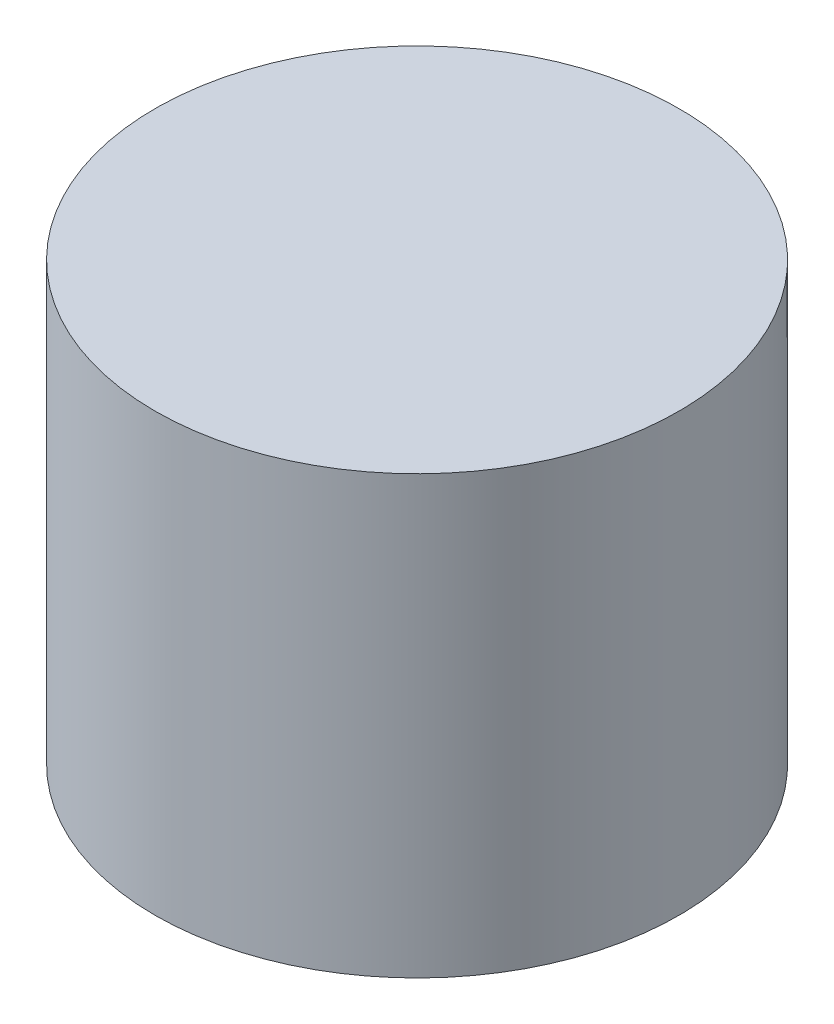
ISO-10303-21;
HEADER;
FILE_DESCRIPTION(('STEP AP214'),'2;1');
FILE_NAME('part.step','',(''),(''),'','','');
FILE_SCHEMA(('AUTOMOTIVE_DESIGN { 1 0 10303 214 1 1 1 1 }'));
ENDSEC;
DATA;
#1=APPLICATION_CONTEXT('core data for automotive mechanical design processes');
#2=APPLICATION_PROTOCOL_DEFINITION('international standard','automotive_design',2000,#1);
#3=PRODUCT_CONTEXT('',#1,'mechanical');
#4=PRODUCT('Part','Part','',(#3));
#5=PRODUCT_RELATED_PRODUCT_CATEGORY('part','',(#4));
#6=PRODUCT_DEFINITION_FORMATION('','',#4);
#7=PRODUCT_DEFINITION_CONTEXT('part definition',#1,'design');
#8=PRODUCT_DEFINITION('design','',#6,#7);
#9=PRODUCT_DEFINITION_SHAPE('','',#8);
#10=(LENGTH_UNIT() NAMED_UNIT(*) SI_UNIT(.MILLI.,.METRE.));
#11=(NAMED_UNIT(*) PLANE_ANGLE_UNIT() SI_UNIT($,.RADIAN.));
#12=(NAMED_UNIT(*) SI_UNIT($,.STERADIAN.) SOLID_ANGLE_UNIT());
#13=UNCERTAINTY_MEASURE_WITH_UNIT(LENGTH_MEASURE(1.E-05),#10,'distance_accuracy_value','');
#14=(GEOMETRIC_REPRESENTATION_CONTEXT(3) GLOBAL_UNCERTAINTY_ASSIGNED_CONTEXT((#13)) GLOBAL_UNIT_ASSIGNED_CONTEXT((#10,
#11,#12)) REPRESENTATION_CONTEXT('',''));
#15=CARTESIAN_POINT('',(0.,0.,0.));
#16=DIRECTION('',(0.,0.,1.));
#17=DIRECTION('',(1.,0.,0.));
#18=AXIS2_PLACEMENT_3D('',#15,#16,#17);
#19=CARTESIAN_POINT('',(0.,2.5,0.));
#20=DIRECTION('',(0.,-1.,0.));
#21=DIRECTION('',(0.,0.,-1.));
#22=AXIS2_PLACEMENT_3D('',#19,#20,#21);
#23=CYLINDRICAL_SURFACE('',#22,1.5);
#24=CARTESIAN_POINT('',(0.,2.5,0.));
#25=DIRECTION('',(0.,1.,0.));
#26=DIRECTION('',(0.,0.,1.));
#27=AXIS2_PLACEMENT_3D('',#24,#25,#26);
#28=CIRCLE('',#27,1.5);
#29=CARTESIAN_POINT('',(0.,2.5,1.5));
#30=VERTEX_POINT('',#29);
#31=EDGE_CURVE('E10',#30,#30,#28,.T.);
#32=ORIENTED_EDGE('',*,*,#31,.F.);
#33=EDGE_LOOP('',(#32));
#34=FACE_BOUND('',#33,.T.);
#35=CARTESIAN_POINT('',(0.,0.,0.));
#36=DIRECTION('',(0.,1.,0.));
#37=DIRECTION('',(0.,0.,1.));
#38=AXIS2_PLACEMENT_3D('',#35,#36,#37);
#39=CIRCLE('',#38,1.5);
#40=CARTESIAN_POINT('',(0.,0.,1.5));
#41=VERTEX_POINT('',#40);
#42=EDGE_CURVE('E33',#41,#41,#39,.T.);
#43=ORIENTED_EDGE('',*,*,#42,.T.);
#44=EDGE_LOOP('',(#43));
#45=FACE_BOUND('',#44,.T.);
#46=ADVANCED_FACE('F30',(#34,#45),#23,.T.);
#47=CARTESIAN_POINT('',(0.,2.5,0.));
#48=DIRECTION('',(0.,1.,0.));
#49=DIRECTION('',(0.,0.,1.));
#50=AXIS2_PLACEMENT_3D('',#47,#48,#49);
#51=PLANE('',#50);
#52=ORIENTED_EDGE('',*,*,#31,.T.);
#53=EDGE_LOOP('',(#52));
#54=FACE_BOUND('',#53,.T.);
#55=ADVANCED_FACE('F45',(#54),#51,.T.);
#56=CARTESIAN_POINT('',(0.,0.,0.));
#57=DIRECTION('',(0.,1.,0.));
#58=DIRECTION('',(0.,0.,1.));
#59=AXIS2_PLACEMENT_3D('',#56,#57,#58);
#60=PLANE('',#59);
#61=ORIENTED_EDGE('',*,*,#42,.F.);
#62=EDGE_LOOP('',(#61));
#63=FACE_BOUND('',#62,.T.);
#64=ADVANCED_FACE('F43',(#63),#60,.F.);
#65=CLOSED_SHELL('',(#46,#55,#64));
#66=MANIFOLD_SOLID_BREP('B2',#65);
#67=ADVANCED_BREP_SHAPE_REPRESENTATION('',(#18,#66),#14);
#68=SHAPE_DEFINITION_REPRESENTATION(#9,#67);
ENDSEC;
END-ISO-10303-21;
